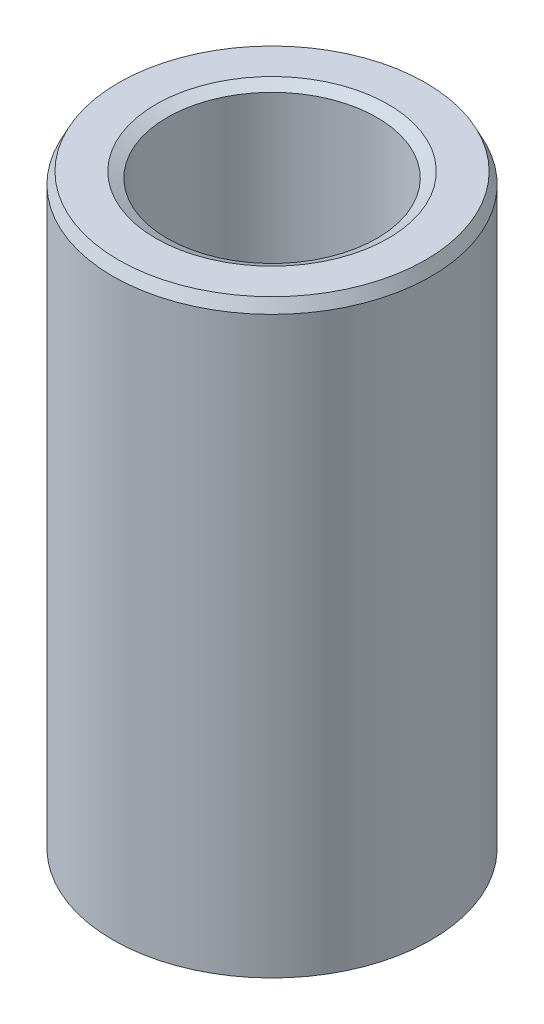
ISO-10303-21;
HEADER;
FILE_DESCRIPTION(('STEP AP214'),'2;1');
FILE_NAME('part.step','',(''),(''),'','','');
FILE_SCHEMA(('AUTOMOTIVE_DESIGN { 1 0 10303 214 1 1 1 1 }'));
ENDSEC;
DATA;
#1=APPLICATION_CONTEXT('core data for automotive mechanical design processes');
#2=APPLICATION_PROTOCOL_DEFINITION('international standard','automotive_design',2000,#1);
#3=PRODUCT_CONTEXT('',#1,'mechanical');
#4=PRODUCT('Part','Part','',(#3));
#5=PRODUCT_RELATED_PRODUCT_CATEGORY('part','',(#4));
#6=PRODUCT_DEFINITION_FORMATION('','',#4);
#7=PRODUCT_DEFINITION_CONTEXT('part definition',#1,'design');
#8=PRODUCT_DEFINITION('design','',#6,#7);
#9=PRODUCT_DEFINITION_SHAPE('','',#8);
#10=(LENGTH_UNIT() NAMED_UNIT(*) SI_UNIT(.MILLI.,.METRE.));
#11=(NAMED_UNIT(*) PLANE_ANGLE_UNIT() SI_UNIT($,.RADIAN.));
#12=(NAMED_UNIT(*) SI_UNIT($,.STERADIAN.) SOLID_ANGLE_UNIT());
#13=UNCERTAINTY_MEASURE_WITH_UNIT(LENGTH_MEASURE(1.E-05),#10,'distance_accuracy_value','');
#14=(GEOMETRIC_REPRESENTATION_CONTEXT(3) GLOBAL_UNCERTAINTY_ASSIGNED_CONTEXT((#13)) GLOBAL_UNIT_ASSIGNED_CONTEXT((#10,
#11,#12)) REPRESENTATION_CONTEXT('',''));
#15=CARTESIAN_POINT('',(0.,0.,0.));
#16=DIRECTION('',(0.,0.,1.));
#17=DIRECTION('',(1.,0.,0.));
#18=AXIS2_PLACEMENT_3D('',#15,#16,#17);
#19=CARTESIAN_POINT('',(0.,185.835119311985,0.));
#20=DIRECTION('',(0.,-1.,0.));
#21=DIRECTION('',(0.,0.,-1.));
#22=AXIS2_PLACEMENT_3D('',#19,#20,#21);
#23=CYLINDRICAL_SURFACE('',#22,50.);
#24=CARTESIAN_POINT('',(0.,1.78038354718582,0.));
#25=DIRECTION('',(0.,1.,0.));
#26=DIRECTION('',(0.,0.,1.));
#27=AXIS2_PLACEMENT_3D('',#24,#25,#26);
#28=CIRCLE('',#27,50.);
#29=CARTESIAN_POINT('',(0.,1.78038354718582,50.));
#30=VERTEX_POINT('',#29);
#31=EDGE_CURVE('E10',#30,#30,#28,.T.);
#32=ORIENTED_EDGE('',*,*,#31,.T.);
#33=EDGE_LOOP('',(#32));
#34=FACE_BOUND('',#33,.T.);
#35=CARTESIAN_POINT('',(0.,182.277504520491,0.));
#36=DIRECTION('',(0.,1.,0.));
#37=DIRECTION('',(0.,0.,1.));
#38=AXIS2_PLACEMENT_3D('',#35,#36,#37);
#39=CIRCLE('',#38,50.);
#40=CARTESIAN_POINT('',(0.,182.277504520491,50.));
#41=VERTEX_POINT('',#40);
#42=EDGE_CURVE('E50',#41,#41,#39,.F.);
#43=ORIENTED_EDGE('',*,*,#42,.T.);
#44=EDGE_LOOP('',(#43));
#45=FACE_BOUND('',#44,.T.);
#46=ADVANCED_FACE('F39',(#34,#45),#23,.T.);
#47=CARTESIAN_POINT('',(0.,185.835119311985,0.));
#48=DIRECTION('',(0.,1.,0.));
#49=DIRECTION('',(0.,0.,1.));
#50=AXIS2_PLACEMENT_3D('',#47,#48,#49);
#51=PLANE('',#50);
#52=CARTESIAN_POINT('',(0.,185.835119311985,0.));
#53=DIRECTION('',(0.,1.,0.));
#54=DIRECTION('',(0.,0.,1.));
#55=AXIS2_PLACEMENT_3D('',#52,#53,#54);
#56=CIRCLE('',#55,36.4834216301131);
#57=CARTESIAN_POINT('',(0.,185.835119311985,36.4834216301131));
#58=VERTEX_POINT('',#57);
#59=EDGE_CURVE('E58',#58,#58,#56,.F.);
#60=ORIENTED_EDGE('',*,*,#59,.T.);
#61=EDGE_LOOP('',(#60));
#62=FACE_BOUND('',#61,.T.);
#63=CARTESIAN_POINT('',(0.,185.835119311985,0.));
#64=DIRECTION('',(0.,1.,0.));
#65=DIRECTION('',(0.,0.,1.));
#66=AXIS2_PLACEMENT_3D('',#63,#64,#65);
#67=CIRCLE('',#66,48.2196164528142);
#68=CARTESIAN_POINT('',(0.,185.835119311985,48.2196164528142));
#69=VERTEX_POINT('',#68);
#70=EDGE_CURVE('E61',#69,#69,#67,.T.);
#71=ORIENTED_EDGE('',*,*,#70,.T.);
#72=EDGE_LOOP('',(#71));
#73=FACE_BOUND('',#72,.T.);
#74=ADVANCED_FACE('F88',(#62,#73),#51,.T.);
#75=CARTESIAN_POINT('',(0.,0.,0.));
#76=DIRECTION('',(0.,1.,0.));
#77=DIRECTION('',(0.,0.,1.));
#78=AXIS2_PLACEMENT_3D('',#75,#76,#77);
#79=PLANE('',#78);
#80=CARTESIAN_POINT('',(0.,0.,0.));
#81=DIRECTION('',(0.,1.,0.));
#82=DIRECTION('',(0.,0.,1.));
#83=AXIS2_PLACEMENT_3D('',#80,#81,#82);
#84=CIRCLE('',#83,34.7061903858046);
#85=CARTESIAN_POINT('',(0.,0.,34.7061903858046));
#86=VERTEX_POINT('',#85);
#87=EDGE_CURVE('E51',#86,#86,#84,.T.);
#88=ORIENTED_EDGE('',*,*,#87,.T.);
#89=EDGE_LOOP('',(#88));
#90=FACE_BOUND('',#89,.T.);
#91=CARTESIAN_POINT('',(0.,0.,0.));
#92=DIRECTION('',(0.,1.,0.));
#93=DIRECTION('',(0.,0.,1.));
#94=AXIS2_PLACEMENT_3D('',#91,#92,#93);
#95=CIRCLE('',#94,46.4423852085057);
#96=CARTESIAN_POINT('',(0.,0.,46.4423852085057));
#97=VERTEX_POINT('',#96);
#98=EDGE_CURVE('E54',#97,#97,#95,.F.);
#99=ORIENTED_EDGE('',*,*,#98,.T.);
#100=EDGE_LOOP('',(#99));
#101=FACE_BOUND('',#100,.T.);
#102=ADVANCED_FACE('F83',(#90,#101),#79,.F.);
#103=CARTESIAN_POINT('',(0.,185.835119311985,0.));
#104=DIRECTION('',(0.,-1.,0.));
#105=DIRECTION('',(0.,0.,-1.));
#106=AXIS2_PLACEMENT_3D('',#103,#104,#105);
#107=CYLINDRICAL_SURFACE('',#106,32.9258068386188);
#108=CARTESIAN_POINT('',(0.,184.054735764799,0.));
#109=DIRECTION('',(0.,1.,0.));
#110=DIRECTION('',(0.,0.,1.));
#111=AXIS2_PLACEMENT_3D('',#108,#109,#110);
#112=CIRCLE('',#111,32.9258068386188);
#113=CARTESIAN_POINT('',(0.,184.054735764799,32.9258068386188));
#114=VERTEX_POINT('',#113);
#115=EDGE_CURVE('E67',#114,#114,#112,.T.);
#116=ORIENTED_EDGE('',*,*,#115,.T.);
#117=EDGE_LOOP('',(#116));
#118=FACE_BOUND('',#117,.T.);
#119=CARTESIAN_POINT('',(0.,3.55761479149436,0.));
#120=DIRECTION('',(0.,1.,0.));
#121=DIRECTION('',(0.,0.,1.));
#122=AXIS2_PLACEMENT_3D('',#119,#120,#121);
#123=CIRCLE('',#122,32.9258068386188);
#124=CARTESIAN_POINT('',(0.,3.55761479149436,32.9258068386188));
#125=VERTEX_POINT('',#124);
#126=EDGE_CURVE('E69',#125,#125,#123,.F.);
#127=ORIENTED_EDGE('',*,*,#126,.T.);
#128=EDGE_LOOP('',(#127));
#129=FACE_BOUND('',#128,.T.);
#130=ADVANCED_FACE('F71',(#118,#129),#107,.F.);
#131=CARTESIAN_POINT('',(0.,184.054735764799,0.));
#132=DIRECTION('',(0.,1.,0.));
#133=DIRECTION('',(0.,0.,1.));
#134=AXIS2_PLACEMENT_3D('',#131,#132,#133);
#135=CONICAL_SURFACE('',#134,32.9258068386188,1.106794351805);
#136=ORIENTED_EDGE('',*,*,#59,.F.);
#137=EDGE_LOOP('',(#136));
#138=FACE_BOUND('',#137,.T.);
#139=ORIENTED_EDGE('',*,*,#115,.F.);
#140=EDGE_LOOP('',(#139));
#141=FACE_BOUND('',#140,.T.);
#142=ADVANCED_FACE('F77',(#138,#141),#135,.F.);
#143=CARTESIAN_POINT('',(0.,0.,0.));
#144=DIRECTION('',(0.,-1.,0.));
#145=DIRECTION('',(0.,0.,-1.));
#146=AXIS2_PLACEMENT_3D('',#143,#144,#145);
#147=CONICAL_SURFACE('',#146,34.7061903858046,0.464001974989888);
#148=ORIENTED_EDGE('',*,*,#126,.F.);
#149=EDGE_LOOP('',(#148));
#150=FACE_BOUND('',#149,.T.);
#151=ORIENTED_EDGE('',*,*,#87,.F.);
#152=EDGE_LOOP('',(#151));
#153=FACE_BOUND('',#152,.T.);
#154=ADVANCED_FACE('F73',(#150,#153),#147,.F.);
#155=CARTESIAN_POINT('',(0.,1.78038354718582,0.));
#156=DIRECTION('',(0.,1.,0.));
#157=DIRECTION('',(0.,0.,1.));
#158=AXIS2_PLACEMENT_3D('',#155,#156,#157);
#159=CONICAL_SURFACE('',#158,50.,1.10679435180501);
#160=ORIENTED_EDGE('',*,*,#98,.F.);
#161=EDGE_LOOP('',(#160));
#162=FACE_BOUND('',#161,.T.);
#163=ORIENTED_EDGE('',*,*,#31,.F.);
#164=EDGE_LOOP('',(#163));
#165=FACE_BOUND('',#164,.T.);
#166=ADVANCED_FACE('F76',(#162,#165),#159,.T.);
#167=CARTESIAN_POINT('',(0.,185.835119311985,0.));
#168=DIRECTION('',(0.,-1.,0.));
#169=DIRECTION('',(0.,0.,-1.));
#170=AXIS2_PLACEMENT_3D('',#167,#168,#169);
#171=CONICAL_SURFACE('',#170,48.2196164528142,0.464001974989885);
#172=ORIENTED_EDGE('',*,*,#42,.F.);
#173=EDGE_LOOP('',(#172));
#174=FACE_BOUND('',#173,.T.);
#175=ORIENTED_EDGE('',*,*,#70,.F.);
#176=EDGE_LOOP('',(#175));
#177=FACE_BOUND('',#176,.T.);
#178=ADVANCED_FACE('F45',(#174,#177),#171,.T.);
#179=CLOSED_SHELL('',(#46,#74,#102,#130,#142,#154,#166,#178));
#180=MANIFOLD_SOLID_BREP('B2',#179);
#181=ADVANCED_BREP_SHAPE_REPRESENTATION('',(#18,#180),#14);
#182=SHAPE_DEFINITION_REPRESENTATION(#9,#181);
ENDSEC;
END-ISO-10303-21;
